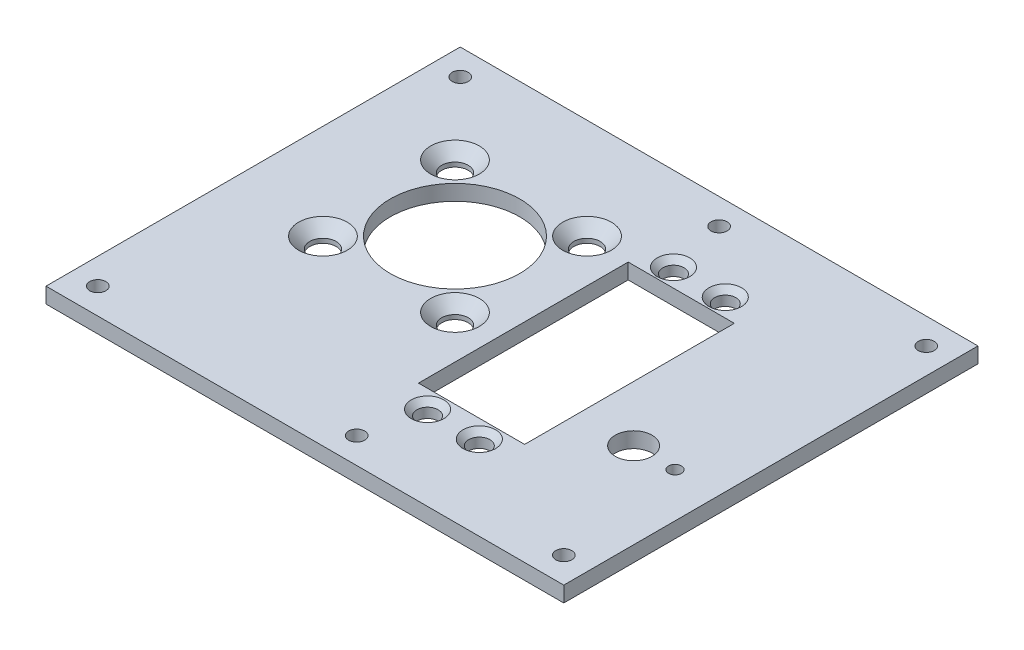
ISO-10303-21;
HEADER;
FILE_DESCRIPTION(('STEP AP214'),'2;1');
FILE_NAME('part.step','',(''),(''),'','','');
FILE_SCHEMA(('AUTOMOTIVE_DESIGN { 1 0 10303 214 1 1 1 1 }'));
ENDSEC;
DATA;
#1=APPLICATION_CONTEXT('core data for automotive mechanical design processes');
#2=APPLICATION_PROTOCOL_DEFINITION('international standard','automotive_design',2000,#1);
#3=PRODUCT_CONTEXT('',#1,'mechanical');
#4=PRODUCT('Part','Part','',(#3));
#5=PRODUCT_RELATED_PRODUCT_CATEGORY('part','',(#4));
#6=PRODUCT_DEFINITION_FORMATION('','',#4);
#7=PRODUCT_DEFINITION_CONTEXT('part definition',#1,'design');
#8=PRODUCT_DEFINITION('design','',#6,#7);
#9=PRODUCT_DEFINITION_SHAPE('','',#8);
#10=(LENGTH_UNIT() NAMED_UNIT(*) SI_UNIT(.MILLI.,.METRE.));
#11=(NAMED_UNIT(*) PLANE_ANGLE_UNIT() SI_UNIT($,.RADIAN.));
#12=(NAMED_UNIT(*) SI_UNIT($,.STERADIAN.) SOLID_ANGLE_UNIT());
#13=UNCERTAINTY_MEASURE_WITH_UNIT(LENGTH_MEASURE(1.E-05),#10,'distance_accuracy_value','');
#14=(GEOMETRIC_REPRESENTATION_CONTEXT(3) GLOBAL_UNCERTAINTY_ASSIGNED_CONTEXT((#13)) GLOBAL_UNIT_ASSIGNED_CONTEXT((#10,
#11,#12)) REPRESENTATION_CONTEXT('',''));
#15=CARTESIAN_POINT('',(0.,0.,0.));
#16=DIRECTION('',(0.,0.,1.));
#17=DIRECTION('',(1.,0.,0.));
#18=AXIS2_PLACEMENT_3D('',#15,#16,#17);
#19=CARTESIAN_POINT('',(0.,3.,-11.4110340583505));
#20=DIRECTION('',(0.,0.,-1.));
#21=DIRECTION('',(-1.,0.,0.));
#22=AXIS2_PLACEMENT_3D('',#19,#20,#21);
#23=PLANE('',#22);
#24=DIRECTION('',(1.,0.,0.));
#25=VECTOR('',#24,1.);
#26=CARTESIAN_POINT('',(0.,0.,-11.4110340583505));
#27=LINE('',#26,#25);
#28=CARTESIAN_POINT('',(13.5251162978277,0.,-11.4110340583505));
#29=VERTEX_POINT('',#28);
#30=CARTESIAN_POINT('',(34.0251162978277,0.,-11.4110340583505));
#31=VERTEX_POINT('',#30);
#32=EDGE_CURVE('E233',#29,#31,#27,.T.);
#33=ORIENTED_EDGE('',*,*,#32,.T.);
#34=DIRECTION('',(0.,-1.,0.));
#35=VECTOR('',#34,1.);
#36=CARTESIAN_POINT('',(34.0251162978277,3.,-11.4110340583505));
#37=LINE('',#36,#35);
#38=CARTESIAN_POINT('',(34.0251162978277,3.,-11.4110340583505));
#39=VERTEX_POINT('',#38);
#40=EDGE_CURVE('E11',#39,#31,#37,.T.);
#41=ORIENTED_EDGE('',*,*,#40,.F.);
#42=DIRECTION('',(1.,0.,0.));
#43=VECTOR('',#42,1.);
#44=CARTESIAN_POINT('',(0.,3.,-11.4110340583505));
#45=LINE('',#44,#43);
#46=CARTESIAN_POINT('',(13.5251162978277,3.,-11.4110340583505));
#47=VERTEX_POINT('',#46);
#48=EDGE_CURVE('E127',#47,#39,#45,.T.);
#49=ORIENTED_EDGE('',*,*,#48,.F.);
#50=DIRECTION('',(0.,-1.,0.));
#51=VECTOR('',#50,1.);
#52=CARTESIAN_POINT('',(13.5251162978277,3.,-11.4110340583505));
#53=LINE('',#52,#51);
#54=EDGE_CURVE('E67',#47,#29,#53,.T.);
#55=ORIENTED_EDGE('',*,*,#54,.T.);
#56=EDGE_LOOP('',(#33,#41,#49,#55));
#57=FACE_BOUND('',#56,.T.);
#58=ADVANCED_FACE('F47',(#57),#23,.F.);
#59=CARTESIAN_POINT('',(34.0251162978277,3.,0.));
#60=DIRECTION('',(1.,0.,0.));
#61=DIRECTION('',(0.,0.,-1.));
#62=AXIS2_PLACEMENT_3D('',#59,#60,#61);
#63=PLANE('',#62);
#64=DIRECTION('',(0.,0.,1.));
#65=VECTOR('',#64,1.);
#66=CARTESIAN_POINT('',(34.0251162978277,0.,0.));
#67=LINE('',#66,#65);
#68=CARTESIAN_POINT('',(34.0251162978277,0.,29.0889659416495));
#69=VERTEX_POINT('',#68);
#70=EDGE_CURVE('E134',#31,#69,#67,.T.);
#71=ORIENTED_EDGE('',*,*,#70,.T.);
#72=DIRECTION('',(0.,-1.,0.));
#73=VECTOR('',#72,1.);
#74=CARTESIAN_POINT('',(34.0251162978277,3.,29.0889659416495));
#75=LINE('',#74,#73);
#76=CARTESIAN_POINT('',(34.0251162978277,3.,29.0889659416495));
#77=VERTEX_POINT('',#76);
#78=EDGE_CURVE('E58',#77,#69,#75,.T.);
#79=ORIENTED_EDGE('',*,*,#78,.F.);
#80=DIRECTION('',(0.,0.,1.));
#81=VECTOR('',#80,1.);
#82=CARTESIAN_POINT('',(34.0251162978277,3.,0.));
#83=LINE('',#82,#81);
#84=EDGE_CURVE('E121',#39,#77,#83,.T.);
#85=ORIENTED_EDGE('',*,*,#84,.F.);
#86=ORIENTED_EDGE('',*,*,#40,.T.);
#87=EDGE_LOOP('',(#71,#79,#85,#86));
#88=FACE_BOUND('',#87,.T.);
#89=ADVANCED_FACE('F133',(#88),#63,.F.);
#90=CARTESIAN_POINT('',(0.,3.,29.0889659416495));
#91=DIRECTION('',(0.,0.,-1.));
#92=DIRECTION('',(-1.,0.,0.));
#93=AXIS2_PLACEMENT_3D('',#90,#91,#92);
#94=PLANE('',#93);
#95=DIRECTION('',(1.,0.,0.));
#96=VECTOR('',#95,1.);
#97=CARTESIAN_POINT('',(0.,0.,29.0889659416495));
#98=LINE('',#97,#96);
#99=CARTESIAN_POINT('',(13.5251162978277,0.,29.0889659416495));
#100=VERTEX_POINT('',#99);
#101=EDGE_CURVE('E238',#100,#69,#98,.T.);
#102=ORIENTED_EDGE('',*,*,#101,.F.);
#103=DIRECTION('',(0.,-1.,0.));
#104=VECTOR('',#103,1.);
#105=CARTESIAN_POINT('',(13.5251162978277,3.,29.0889659416495));
#106=LINE('',#105,#104);
#107=CARTESIAN_POINT('',(13.5251162978277,3.,29.0889659416495));
#108=VERTEX_POINT('',#107);
#109=EDGE_CURVE('E93',#108,#100,#106,.T.);
#110=ORIENTED_EDGE('',*,*,#109,.F.);
#111=DIRECTION('',(1.,0.,0.));
#112=VECTOR('',#111,1.);
#113=CARTESIAN_POINT('',(0.,3.,29.0889659416495));
#114=LINE('',#113,#112);
#115=EDGE_CURVE('E126',#108,#77,#114,.T.);
#116=ORIENTED_EDGE('',*,*,#115,.T.);
#117=ORIENTED_EDGE('',*,*,#78,.T.);
#118=EDGE_LOOP('',(#102,#110,#116,#117));
#119=FACE_BOUND('',#118,.T.);
#120=ADVANCED_FACE('F139',(#119),#94,.T.);
#121=CARTESIAN_POINT('',(61.3367190973659,3.,0.));
#122=DIRECTION('',(1.,0.,0.));
#123=DIRECTION('',(0.,0.,-1.));
#124=AXIS2_PLACEMENT_3D('',#121,#122,#123);
#125=PLANE('',#124);
#126=DIRECTION('',(0.,0.,1.));
#127=VECTOR('',#126,1.);
#128=CARTESIAN_POINT('',(61.3367190973659,0.,0.));
#129=LINE('',#128,#127);
#130=CARTESIAN_POINT('',(61.3367190973659,0.,-31.1610340583505));
#131=VERTEX_POINT('',#130);
#132=CARTESIAN_POINT('',(61.3367190973659,0.,48.8389659416495));
#133=VERTEX_POINT('',#132);
#134=EDGE_CURVE('E217',#131,#133,#129,.T.);
#135=ORIENTED_EDGE('',*,*,#134,.F.);
#136=DIRECTION('',(0.,-1.,0.));
#137=VECTOR('',#136,1.);
#138=CARTESIAN_POINT('',(61.3367190973659,3.,-31.1610340583505));
#139=LINE('',#138,#137);
#140=CARTESIAN_POINT('',(61.3367190973659,3.,-31.1610340583505));
#141=VERTEX_POINT('',#140);
#142=EDGE_CURVE('E51',#141,#131,#139,.T.);
#143=ORIENTED_EDGE('',*,*,#142,.F.);
#144=DIRECTION('',(0.,0.,1.));
#145=VECTOR('',#144,1.);
#146=CARTESIAN_POINT('',(61.3367190973659,3.,0.));
#147=LINE('',#146,#145);
#148=CARTESIAN_POINT('',(61.3367190973659,3.,48.8389659416495));
#149=VERTEX_POINT('',#148);
#150=EDGE_CURVE('E285',#141,#149,#147,.T.);
#151=ORIENTED_EDGE('',*,*,#150,.T.);
#152=DIRECTION('',(0.,-1.,0.));
#153=VECTOR('',#152,1.);
#154=CARTESIAN_POINT('',(61.3367190973659,3.,48.8389659416495));
#155=LINE('',#154,#153);
#156=EDGE_CURVE('E144',#149,#133,#155,.T.);
#157=ORIENTED_EDGE('',*,*,#156,.T.);
#158=EDGE_LOOP('',(#135,#143,#151,#157));
#159=FACE_BOUND('',#158,.T.);
#160=ADVANCED_FACE('F267',(#159),#125,.T.);
#161=CARTESIAN_POINT('',(0.,3.,-31.1610340583505));
#162=DIRECTION('',(0.,0.,-1.));
#163=DIRECTION('',(-1.,0.,0.));
#164=AXIS2_PLACEMENT_3D('',#161,#162,#163);
#165=PLANE('',#164);
#166=DIRECTION('',(1.,0.,0.));
#167=VECTOR('',#166,1.);
#168=CARTESIAN_POINT('',(0.,0.,-31.1610340583505));
#169=LINE('',#168,#167);
#170=CARTESIAN_POINT('',(-38.6632809026341,0.,-31.1610340583505));
#171=VERTEX_POINT('',#170);
#172=EDGE_CURVE('E221',#171,#131,#169,.T.);
#173=ORIENTED_EDGE('',*,*,#172,.F.);
#174=DIRECTION('',(0.,-1.,0.));
#175=VECTOR('',#174,1.);
#176=CARTESIAN_POINT('',(-38.6632809026341,3.,-31.1610340583505));
#177=LINE('',#176,#175);
#178=CARTESIAN_POINT('',(-38.6632809026341,3.,-31.1610340583505));
#179=VERTEX_POINT('',#178);
#180=EDGE_CURVE('E255',#179,#171,#177,.T.);
#181=ORIENTED_EDGE('',*,*,#180,.F.);
#182=DIRECTION('',(1.,0.,0.));
#183=VECTOR('',#182,1.);
#184=CARTESIAN_POINT('',(0.,3.,-31.1610340583505));
#185=LINE('',#184,#183);
#186=EDGE_CURVE('E266',#179,#141,#185,.T.);
#187=ORIENTED_EDGE('',*,*,#186,.T.);
#188=ORIENTED_EDGE('',*,*,#142,.T.);
#189=EDGE_LOOP('',(#173,#181,#187,#188));
#190=FACE_BOUND('',#189,.T.);
#191=ADVANCED_FACE('F264',(#190),#165,.T.);
#192=CARTESIAN_POINT('',(-38.6632809026341,3.,0.));
#193=DIRECTION('',(1.,0.,0.));
#194=DIRECTION('',(0.,0.,-1.));
#195=AXIS2_PLACEMENT_3D('',#192,#193,#194);
#196=PLANE('',#195);
#197=DIRECTION('',(0.,0.,1.));
#198=VECTOR('',#197,1.);
#199=CARTESIAN_POINT('',(-38.6632809026341,0.,0.));
#200=LINE('',#199,#198);
#201=CARTESIAN_POINT('',(-38.6632809026341,0.,48.8389659416495));
#202=VERTEX_POINT('',#201);
#203=EDGE_CURVE('E225',#171,#202,#200,.T.);
#204=ORIENTED_EDGE('',*,*,#203,.T.);
#205=DIRECTION('',(0.,-1.,0.));
#206=VECTOR('',#205,1.);
#207=CARTESIAN_POINT('',(-38.6632809026341,3.,48.8389659416495));
#208=LINE('',#207,#206);
#209=CARTESIAN_POINT('',(-38.6632809026341,3.,48.8389659416495));
#210=VERTEX_POINT('',#209);
#211=EDGE_CURVE('E252',#210,#202,#208,.T.);
#212=ORIENTED_EDGE('',*,*,#211,.F.);
#213=DIRECTION('',(0.,0.,1.));
#214=VECTOR('',#213,1.);
#215=CARTESIAN_POINT('',(-38.6632809026341,3.,0.));
#216=LINE('',#215,#214);
#217=EDGE_CURVE('E275',#179,#210,#216,.T.);
#218=ORIENTED_EDGE('',*,*,#217,.F.);
#219=ORIENTED_EDGE('',*,*,#180,.T.);
#220=EDGE_LOOP('',(#204,#212,#218,#219));
#221=FACE_BOUND('',#220,.T.);
#222=ADVANCED_FACE('F273',(#221),#196,.F.);
#223=CARTESIAN_POINT('',(0.,3.,48.8389659416495));
#224=DIRECTION('',(0.,0.,-1.));
#225=DIRECTION('',(-1.,0.,0.));
#226=AXIS2_PLACEMENT_3D('',#223,#224,#225);
#227=PLANE('',#226);
#228=DIRECTION('',(1.,0.,0.));
#229=VECTOR('',#228,1.);
#230=CARTESIAN_POINT('',(0.,0.,48.8389659416495));
#231=LINE('',#230,#229);
#232=EDGE_CURVE('E229',#202,#133,#231,.T.);
#233=ORIENTED_EDGE('',*,*,#232,.T.);
#234=ORIENTED_EDGE('',*,*,#156,.F.);
#235=DIRECTION('',(1.,0.,0.));
#236=VECTOR('',#235,1.);
#237=CARTESIAN_POINT('',(0.,3.,48.8389659416495));
#238=LINE('',#237,#236);
#239=EDGE_CURVE('E278',#210,#149,#238,.T.);
#240=ORIENTED_EDGE('',*,*,#239,.F.);
#241=ORIENTED_EDGE('',*,*,#211,.T.);
#242=EDGE_LOOP('',(#233,#234,#240,#241));
#243=FACE_BOUND('',#242,.T.);
#244=ADVANCED_FACE('F277',(#243),#227,.F.);
#245=CARTESIAN_POINT('',(-7.51877009888325,3.,0.993104788287176));
#246=DIRECTION('',(0.,-1.,0.));
#247=DIRECTION('',(0.,0.,-1.));
#248=AXIS2_PLACEMENT_3D('',#245,#246,#247);
#249=CYLINDRICAL_SURFACE('',#248,12.5);
#250=CARTESIAN_POINT('',(-7.51877009888325,3.,0.993104788287176));
#251=DIRECTION('',(0.,1.,0.));
#252=DIRECTION('',(0.,0.,1.));
#253=AXIS2_PLACEMENT_3D('',#250,#251,#252);
#254=CIRCLE('',#253,12.5);
#255=CARTESIAN_POINT('',(-7.51877009888325,3.,13.4931047882872));
#256=VERTEX_POINT('',#255);
#257=EDGE_CURVE('E291',#256,#256,#254,.T.);
#258=ORIENTED_EDGE('',*,*,#257,.T.);
#259=EDGE_LOOP('',(#258));
#260=FACE_BOUND('',#259,.T.);
#261=CARTESIAN_POINT('',(-7.51877009888325,0.,0.993104788287176));
#262=DIRECTION('',(0.,1.,0.));
#263=DIRECTION('',(0.,0.,1.));
#264=AXIS2_PLACEMENT_3D('',#261,#262,#263);
#265=CIRCLE('',#264,12.5);
#266=CARTESIAN_POINT('',(-7.51877009888325,0.,13.4931047882872));
#267=VERTEX_POINT('',#266);
#268=EDGE_CURVE('E213',#267,#267,#265,.T.);
#269=ORIENTED_EDGE('',*,*,#268,.F.);
#270=EDGE_LOOP('',(#269));
#271=FACE_BOUND('',#270,.T.);
#272=ADVANCED_FACE('F428',(#260,#271),#249,.F.);
#273=CARTESIAN_POINT('',(-20.2687700988833,3.,-11.7568952117128));
#274=DIRECTION('',(0.,-1.,0.));
#275=DIRECTION('',(0.,0.,-1.));
#276=AXIS2_PLACEMENT_3D('',#273,#274,#275);
#277=CYLINDRICAL_SURFACE('',#276,2.55);
#278=CARTESIAN_POINT('',(-20.2687700988833,0.85,-11.7568952117128));
#279=DIRECTION('',(0.,1.,0.));
#280=DIRECTION('',(0.,0.,1.));
#281=AXIS2_PLACEMENT_3D('',#278,#279,#280);
#282=CIRCLE('',#281,2.55);
#283=CARTESIAN_POINT('',(-20.2687700988833,0.85,-9.20689521171283));
#284=VERTEX_POINT('',#283);
#285=EDGE_CURVE('E153',#284,#284,#282,.F.);
#286=ORIENTED_EDGE('',*,*,#285,.F.);
#287=EDGE_LOOP('',(#286));
#288=FACE_BOUND('',#287,.T.);
#289=CARTESIAN_POINT('',(-20.2687700988833,0.,-11.7568952117128));
#290=DIRECTION('',(0.,1.,0.));
#291=DIRECTION('',(0.,0.,1.));
#292=AXIS2_PLACEMENT_3D('',#289,#290,#291);
#293=CIRCLE('',#292,2.55);
#294=CARTESIAN_POINT('',(-20.2687700988833,0.,-9.20689521171283));
#295=VERTEX_POINT('',#294);
#296=EDGE_CURVE('E209',#295,#295,#293,.T.);
#297=ORIENTED_EDGE('',*,*,#296,.F.);
#298=EDGE_LOOP('',(#297));
#299=FACE_BOUND('',#298,.T.);
#300=ADVANCED_FACE('F431',(#288,#299),#277,.F.);
#301=CARTESIAN_POINT('',(5.23122990111676,3.,-11.7568952117128));
#302=DIRECTION('',(0.,-1.,0.));
#303=DIRECTION('',(0.,0.,-1.));
#304=AXIS2_PLACEMENT_3D('',#301,#302,#303);
#305=CYLINDRICAL_SURFACE('',#304,2.55);
#306=CARTESIAN_POINT('',(5.23122990111676,0.850000000000001,-11.7568952117128));
#307=DIRECTION('',(0.,1.,0.));
#308=DIRECTION('',(0.,0.,1.));
#309=AXIS2_PLACEMENT_3D('',#306,#307,#308);
#310=CIRCLE('',#309,2.55);
#311=CARTESIAN_POINT('',(5.23122990111676,0.850000000000001,-9.20689521171283));
#312=VERTEX_POINT('',#311);
#313=EDGE_CURVE('E333',#312,#312,#310,.F.);
#314=ORIENTED_EDGE('',*,*,#313,.F.);
#315=EDGE_LOOP('',(#314));
#316=FACE_BOUND('',#315,.T.);
#317=CARTESIAN_POINT('',(5.23122990111676,0.,-11.7568952117128));
#318=DIRECTION('',(0.,1.,0.));
#319=DIRECTION('',(0.,0.,1.));
#320=AXIS2_PLACEMENT_3D('',#317,#318,#319);
#321=CIRCLE('',#320,2.55);
#322=CARTESIAN_POINT('',(5.23122990111676,0.,-9.20689521171283));
#323=VERTEX_POINT('',#322);
#324=EDGE_CURVE('E205',#323,#323,#321,.T.);
#325=ORIENTED_EDGE('',*,*,#324,.F.);
#326=EDGE_LOOP('',(#325));
#327=FACE_BOUND('',#326,.T.);
#328=ADVANCED_FACE('F466',(#316,#327),#305,.F.);
#329=CARTESIAN_POINT('',(5.23122990111676,3.,13.7431047882872));
#330=DIRECTION('',(0.,-1.,0.));
#331=DIRECTION('',(0.,0.,-1.));
#332=AXIS2_PLACEMENT_3D('',#329,#330,#331);
#333=CYLINDRICAL_SURFACE('',#332,2.55);
#334=CARTESIAN_POINT('',(5.23122990111676,0.850000000000001,13.7431047882872));
#335=DIRECTION('',(0.,1.,0.));
#336=DIRECTION('',(0.,0.,1.));
#337=AXIS2_PLACEMENT_3D('',#334,#335,#336);
#338=CIRCLE('',#337,2.55);
#339=CARTESIAN_POINT('',(5.23122990111676,0.850000000000001,16.2931047882872));
#340=VERTEX_POINT('',#339);
#341=EDGE_CURVE('E341',#340,#340,#338,.F.);
#342=ORIENTED_EDGE('',*,*,#341,.F.);
#343=EDGE_LOOP('',(#342));
#344=FACE_BOUND('',#343,.T.);
#345=CARTESIAN_POINT('',(5.23122990111676,0.,13.7431047882872));
#346=DIRECTION('',(0.,1.,0.));
#347=DIRECTION('',(0.,0.,1.));
#348=AXIS2_PLACEMENT_3D('',#345,#346,#347);
#349=CIRCLE('',#348,2.55);
#350=CARTESIAN_POINT('',(5.23122990111676,0.,16.2931047882872));
#351=VERTEX_POINT('',#350);
#352=EDGE_CURVE('E201',#351,#351,#349,.T.);
#353=ORIENTED_EDGE('',*,*,#352,.F.);
#354=EDGE_LOOP('',(#353));
#355=FACE_BOUND('',#354,.T.);
#356=ADVANCED_FACE('F470',(#344,#355),#333,.F.);
#357=CARTESIAN_POINT('',(-20.2687700988832,3.,13.7431047882872));
#358=DIRECTION('',(0.,-1.,0.));
#359=DIRECTION('',(0.,0.,-1.));
#360=AXIS2_PLACEMENT_3D('',#357,#358,#359);
#361=CYLINDRICAL_SURFACE('',#360,2.55);
#362=CARTESIAN_POINT('',(-20.2687700988832,0.85,13.7431047882872));
#363=DIRECTION('',(0.,1.,0.));
#364=DIRECTION('',(0.,0.,1.));
#365=AXIS2_PLACEMENT_3D('',#362,#363,#364);
#366=CIRCLE('',#365,2.55);
#367=CARTESIAN_POINT('',(-20.2687700988832,0.85,16.2931047882872));
#368=VERTEX_POINT('',#367);
#369=EDGE_CURVE('E349',#368,#368,#366,.F.);
#370=ORIENTED_EDGE('',*,*,#369,.F.);
#371=EDGE_LOOP('',(#370));
#372=FACE_BOUND('',#371,.T.);
#373=CARTESIAN_POINT('',(-20.2687700988832,0.,13.7431047882872));
#374=DIRECTION('',(0.,1.,0.));
#375=DIRECTION('',(0.,0.,1.));
#376=AXIS2_PLACEMENT_3D('',#373,#374,#375);
#377=CIRCLE('',#376,2.55);
#378=CARTESIAN_POINT('',(-20.2687700988832,0.,16.2931047882872));
#379=VERTEX_POINT('',#378);
#380=EDGE_CURVE('E197',#379,#379,#377,.T.);
#381=ORIENTED_EDGE('',*,*,#380,.F.);
#382=EDGE_LOOP('',(#381));
#383=FACE_BOUND('',#382,.T.);
#384=ADVANCED_FACE('F474',(#372,#383),#361,.F.);
#385=CARTESIAN_POINT('',(18.7751162978277,3.,-14.9110340583505));
#386=DIRECTION('',(0.,-1.,0.));
#387=DIRECTION('',(0.,0.,-1.));
#388=AXIS2_PLACEMENT_3D('',#385,#386,#387);
#389=CYLINDRICAL_SURFACE('',#388,2.05);
#390=CARTESIAN_POINT('',(18.7751162978277,1.9,-14.9110340583505));
#391=DIRECTION('',(0.,1.,0.));
#392=DIRECTION('',(0.,0.,1.));
#393=AXIS2_PLACEMENT_3D('',#390,#391,#392);
#394=CIRCLE('',#393,2.05);
#395=CARTESIAN_POINT('',(18.7751162978277,1.9,-12.8610340583505));
#396=VERTEX_POINT('',#395);
#397=EDGE_CURVE('E381',#396,#396,#394,.F.);
#398=ORIENTED_EDGE('',*,*,#397,.F.);
#399=EDGE_LOOP('',(#398));
#400=FACE_BOUND('',#399,.T.);
#401=CARTESIAN_POINT('',(18.7751162978277,0.,-14.9110340583505));
#402=DIRECTION('',(0.,1.,0.));
#403=DIRECTION('',(0.,0.,1.));
#404=AXIS2_PLACEMENT_3D('',#401,#402,#403);
#405=CIRCLE('',#404,2.05);
#406=CARTESIAN_POINT('',(18.7751162978277,0.,-12.8610340583505));
#407=VERTEX_POINT('',#406);
#408=EDGE_CURVE('E193',#407,#407,#405,.T.);
#409=ORIENTED_EDGE('',*,*,#408,.F.);
#410=EDGE_LOOP('',(#409));
#411=FACE_BOUND('',#410,.T.);
#412=ADVANCED_FACE('F478',(#400,#411),#389,.F.);
#413=CARTESIAN_POINT('',(28.7751162978277,3.,-14.9110340583505));
#414=DIRECTION('',(0.,-1.,0.));
#415=DIRECTION('',(0.,0.,-1.));
#416=AXIS2_PLACEMENT_3D('',#413,#414,#415);
#417=CYLINDRICAL_SURFACE('',#416,2.05);
#418=CARTESIAN_POINT('',(28.7751162978277,1.9,-14.9110340583505));
#419=DIRECTION('',(0.,1.,0.));
#420=DIRECTION('',(0.,0.,1.));
#421=AXIS2_PLACEMENT_3D('',#418,#419,#420);
#422=CIRCLE('',#421,2.05);
#423=CARTESIAN_POINT('',(28.7751162978277,1.9,-12.8610340583505));
#424=VERTEX_POINT('',#423);
#425=EDGE_CURVE('E373',#424,#424,#422,.F.);
#426=ORIENTED_EDGE('',*,*,#425,.F.);
#427=EDGE_LOOP('',(#426));
#428=FACE_BOUND('',#427,.T.);
#429=CARTESIAN_POINT('',(28.7751162978277,0.,-14.9110340583505));
#430=DIRECTION('',(0.,1.,0.));
#431=DIRECTION('',(0.,0.,1.));
#432=AXIS2_PLACEMENT_3D('',#429,#430,#431);
#433=CIRCLE('',#432,2.05);
#434=CARTESIAN_POINT('',(28.7751162978277,0.,-12.8610340583505));
#435=VERTEX_POINT('',#434);
#436=EDGE_CURVE('E189',#435,#435,#433,.T.);
#437=ORIENTED_EDGE('',*,*,#436,.F.);
#438=EDGE_LOOP('',(#437));
#439=FACE_BOUND('',#438,.T.);
#440=ADVANCED_FACE('F482',(#428,#439),#417,.F.);
#441=CARTESIAN_POINT('',(18.7751162978277,3.,32.5889659416495));
#442=DIRECTION('',(0.,-1.,0.));
#443=DIRECTION('',(0.,0.,-1.));
#444=AXIS2_PLACEMENT_3D('',#441,#442,#443);
#445=CYLINDRICAL_SURFACE('',#444,2.05);
#446=CARTESIAN_POINT('',(18.7751162978277,1.9,32.5889659416495));
#447=DIRECTION('',(0.,1.,0.));
#448=DIRECTION('',(0.,0.,1.));
#449=AXIS2_PLACEMENT_3D('',#446,#447,#448);
#450=CIRCLE('',#449,2.05);
#451=CARTESIAN_POINT('',(18.7751162978277,1.9,34.6389659416496));
#452=VERTEX_POINT('',#451);
#453=EDGE_CURVE('E365',#452,#452,#450,.F.);
#454=ORIENTED_EDGE('',*,*,#453,.F.);
#455=EDGE_LOOP('',(#454));
#456=FACE_BOUND('',#455,.T.);
#457=CARTESIAN_POINT('',(18.7751162978277,0.,32.5889659416495));
#458=DIRECTION('',(0.,1.,0.));
#459=DIRECTION('',(0.,0.,1.));
#460=AXIS2_PLACEMENT_3D('',#457,#458,#459);
#461=CIRCLE('',#460,2.05);
#462=CARTESIAN_POINT('',(18.7751162978277,0.,34.6389659416496));
#463=VERTEX_POINT('',#462);
#464=EDGE_CURVE('E185',#463,#463,#461,.T.);
#465=ORIENTED_EDGE('',*,*,#464,.F.);
#466=EDGE_LOOP('',(#465));
#467=FACE_BOUND('',#466,.T.);
#468=ADVANCED_FACE('F486',(#456,#467),#445,.F.);
#469=CARTESIAN_POINT('',(28.7751162978277,3.,32.5889659416495));
#470=DIRECTION('',(0.,-1.,0.));
#471=DIRECTION('',(0.,0.,-1.));
#472=AXIS2_PLACEMENT_3D('',#469,#470,#471);
#473=CYLINDRICAL_SURFACE('',#472,2.05);
#474=CARTESIAN_POINT('',(28.7751162978277,1.9,32.5889659416495));
#475=DIRECTION('',(0.,1.,0.));
#476=DIRECTION('',(0.,0.,1.));
#477=AXIS2_PLACEMENT_3D('',#474,#475,#476);
#478=CIRCLE('',#477,2.05);
#479=CARTESIAN_POINT('',(28.7751162978277,1.9,34.6389659416496));
#480=VERTEX_POINT('',#479);
#481=EDGE_CURVE('E357',#480,#480,#478,.F.);
#482=ORIENTED_EDGE('',*,*,#481,.F.);
#483=EDGE_LOOP('',(#482));
#484=FACE_BOUND('',#483,.T.);
#485=CARTESIAN_POINT('',(28.7751162978277,0.,32.5889659416495));
#486=DIRECTION('',(0.,1.,0.));
#487=DIRECTION('',(0.,0.,1.));
#488=AXIS2_PLACEMENT_3D('',#485,#486,#487);
#489=CIRCLE('',#488,2.05);
#490=CARTESIAN_POINT('',(28.7751162978277,0.,34.6389659416496));
#491=VERTEX_POINT('',#490);
#492=EDGE_CURVE('E181',#491,#491,#489,.T.);
#493=ORIENTED_EDGE('',*,*,#492,.F.);
#494=EDGE_LOOP('',(#493));
#495=FACE_BOUND('',#494,.T.);
#496=ADVANCED_FACE('F490',(#484,#495),#473,.F.);
#497=CARTESIAN_POINT('',(44.7751162978277,3.,18.7889659416495));
#498=DIRECTION('',(0.,-1.,0.));
#499=DIRECTION('',(0.,0.,-1.));
#500=AXIS2_PLACEMENT_3D('',#497,#498,#499);
#501=CYLINDRICAL_SURFACE('',#500,3.55);
#502=CARTESIAN_POINT('',(44.7751162978277,3.,18.7889659416495));
#503=DIRECTION('',(0.,1.,0.));
#504=DIRECTION('',(0.,0.,1.));
#505=AXIS2_PLACEMENT_3D('',#502,#503,#504);
#506=CIRCLE('',#505,3.55);
#507=CARTESIAN_POINT('',(44.7751162978277,3.,22.3389659416495));
#508=VERTEX_POINT('',#507);
#509=EDGE_CURVE('E295',#508,#508,#506,.T.);
#510=ORIENTED_EDGE('',*,*,#509,.T.);
#511=EDGE_LOOP('',(#510));
#512=FACE_BOUND('',#511,.T.);
#513=CARTESIAN_POINT('',(44.7751162978277,0.,18.7889659416495));
#514=DIRECTION('',(0.,1.,0.));
#515=DIRECTION('',(0.,0.,1.));
#516=AXIS2_PLACEMENT_3D('',#513,#514,#515);
#517=CIRCLE('',#516,3.55);
#518=CARTESIAN_POINT('',(44.7751162978277,0.,22.3389659416495));
#519=VERTEX_POINT('',#518);
#520=EDGE_CURVE('E177',#519,#519,#517,.T.);
#521=ORIENTED_EDGE('',*,*,#520,.F.);
#522=EDGE_LOOP('',(#521));
#523=FACE_BOUND('',#522,.T.);
#524=ADVANCED_FACE('F494',(#512,#523),#501,.F.);
#525=CARTESIAN_POINT('',(-33.6632809026341,3.,-26.1610340583505));
#526=DIRECTION('',(0.,-1.,0.));
#527=DIRECTION('',(0.,0.,-1.));
#528=AXIS2_PLACEMENT_3D('',#525,#526,#527);
#529=CYLINDRICAL_SURFACE('',#528,1.55);
#530=CARTESIAN_POINT('',(-33.6632809026341,3.,-26.1610340583505));
#531=DIRECTION('',(0.,1.,0.));
#532=DIRECTION('',(0.,0.,1.));
#533=AXIS2_PLACEMENT_3D('',#530,#531,#532);
#534=CIRCLE('',#533,1.55);
#535=CARTESIAN_POINT('',(-33.6632809026341,3.,-24.6110340583505));
#536=VERTEX_POINT('',#535);
#537=EDGE_CURVE('E299',#536,#536,#534,.T.);
#538=ORIENTED_EDGE('',*,*,#537,.T.);
#539=EDGE_LOOP('',(#538));
#540=FACE_BOUND('',#539,.T.);
#541=CARTESIAN_POINT('',(-33.6632809026341,0.,-26.1610340583505));
#542=DIRECTION('',(0.,1.,0.));
#543=DIRECTION('',(0.,0.,1.));
#544=AXIS2_PLACEMENT_3D('',#541,#542,#543);
#545=CIRCLE('',#544,1.55);
#546=CARTESIAN_POINT('',(-33.6632809026341,0.,-24.6110340583505));
#547=VERTEX_POINT('',#546);
#548=EDGE_CURVE('E173',#547,#547,#545,.T.);
#549=ORIENTED_EDGE('',*,*,#548,.F.);
#550=EDGE_LOOP('',(#549));
#551=FACE_BOUND('',#550,.T.);
#552=ADVANCED_FACE('F498',(#540,#551),#529,.F.);
#553=CARTESIAN_POINT('',(56.3367190973659,3.,-26.1610340583505));
#554=DIRECTION('',(0.,-1.,0.));
#555=DIRECTION('',(0.,0.,-1.));
#556=AXIS2_PLACEMENT_3D('',#553,#554,#555);
#557=CYLINDRICAL_SURFACE('',#556,1.55);
#558=CARTESIAN_POINT('',(56.3367190973659,3.,-26.1610340583505));
#559=DIRECTION('',(0.,1.,0.));
#560=DIRECTION('',(0.,0.,1.));
#561=AXIS2_PLACEMENT_3D('',#558,#559,#560);
#562=CIRCLE('',#561,1.55);
#563=CARTESIAN_POINT('',(56.3367190973659,3.,-24.6110340583505));
#564=VERTEX_POINT('',#563);
#565=EDGE_CURVE('E303',#564,#564,#562,.T.);
#566=ORIENTED_EDGE('',*,*,#565,.T.);
#567=EDGE_LOOP('',(#566));
#568=FACE_BOUND('',#567,.T.);
#569=CARTESIAN_POINT('',(56.3367190973659,0.,-26.1610340583505));
#570=DIRECTION('',(0.,1.,0.));
#571=DIRECTION('',(0.,0.,1.));
#572=AXIS2_PLACEMENT_3D('',#569,#570,#571);
#573=CIRCLE('',#572,1.55);
#574=CARTESIAN_POINT('',(56.3367190973659,0.,-24.6110340583505));
#575=VERTEX_POINT('',#574);
#576=EDGE_CURVE('E169',#575,#575,#573,.T.);
#577=ORIENTED_EDGE('',*,*,#576,.F.);
#578=EDGE_LOOP('',(#577));
#579=FACE_BOUND('',#578,.T.);
#580=ADVANCED_FACE('F502',(#568,#579),#557,.F.);
#581=CARTESIAN_POINT('',(56.3367190973659,3.,43.8389659416495));
#582=DIRECTION('',(0.,-1.,0.));
#583=DIRECTION('',(0.,0.,-1.));
#584=AXIS2_PLACEMENT_3D('',#581,#582,#583);
#585=CYLINDRICAL_SURFACE('',#584,1.55);
#586=CARTESIAN_POINT('',(56.3367190973659,3.,43.8389659416495));
#587=DIRECTION('',(0.,1.,0.));
#588=DIRECTION('',(0.,0.,1.));
#589=AXIS2_PLACEMENT_3D('',#586,#587,#588);
#590=CIRCLE('',#589,1.55);
#591=CARTESIAN_POINT('',(56.3367190973659,3.,45.3889659416496));
#592=VERTEX_POINT('',#591);
#593=EDGE_CURVE('E307',#592,#592,#590,.T.);
#594=ORIENTED_EDGE('',*,*,#593,.T.);
#595=EDGE_LOOP('',(#594));
#596=FACE_BOUND('',#595,.T.);
#597=CARTESIAN_POINT('',(56.3367190973659,0.,43.8389659416495));
#598=DIRECTION('',(0.,1.,0.));
#599=DIRECTION('',(0.,0.,1.));
#600=AXIS2_PLACEMENT_3D('',#597,#598,#599);
#601=CIRCLE('',#600,1.55);
#602=CARTESIAN_POINT('',(56.3367190973659,0.,45.3889659416496));
#603=VERTEX_POINT('',#602);
#604=EDGE_CURVE('E165',#603,#603,#601,.T.);
#605=ORIENTED_EDGE('',*,*,#604,.F.);
#606=EDGE_LOOP('',(#605));
#607=FACE_BOUND('',#606,.T.);
#608=ADVANCED_FACE('F506',(#596,#607),#585,.F.);
#609=CARTESIAN_POINT('',(-33.6632809026341,3.,43.8389659416495));
#610=DIRECTION('',(0.,-1.,0.));
#611=DIRECTION('',(0.,0.,-1.));
#612=AXIS2_PLACEMENT_3D('',#609,#610,#611);
#613=CYLINDRICAL_SURFACE('',#612,1.55);
#614=CARTESIAN_POINT('',(-33.6632809026341,3.,43.8389659416495));
#615=DIRECTION('',(0.,1.,0.));
#616=DIRECTION('',(0.,0.,1.));
#617=AXIS2_PLACEMENT_3D('',#614,#615,#616);
#618=CIRCLE('',#617,1.55);
#619=CARTESIAN_POINT('',(-33.6632809026341,3.,45.3889659416496));
#620=VERTEX_POINT('',#619);
#621=EDGE_CURVE('E311',#620,#620,#618,.T.);
#622=ORIENTED_EDGE('',*,*,#621,.T.);
#623=EDGE_LOOP('',(#622));
#624=FACE_BOUND('',#623,.T.);
#625=CARTESIAN_POINT('',(-33.6632809026341,0.,43.8389659416495));
#626=DIRECTION('',(0.,1.,0.));
#627=DIRECTION('',(0.,0.,1.));
#628=AXIS2_PLACEMENT_3D('',#625,#626,#627);
#629=CIRCLE('',#628,1.55);
#630=CARTESIAN_POINT('',(-33.6632809026341,0.,45.3889659416496));
#631=VERTEX_POINT('',#630);
#632=EDGE_CURVE('E161',#631,#631,#629,.T.);
#633=ORIENTED_EDGE('',*,*,#632,.F.);
#634=EDGE_LOOP('',(#633));
#635=FACE_BOUND('',#634,.T.);
#636=ADVANCED_FACE('F510',(#624,#635),#613,.F.);
#637=CARTESIAN_POINT('',(16.3367190973659,3.,-26.1610340583505));
#638=DIRECTION('',(0.,-1.,0.));
#639=DIRECTION('',(0.,0.,-1.));
#640=AXIS2_PLACEMENT_3D('',#637,#638,#639);
#641=CYLINDRICAL_SURFACE('',#640,1.55);
#642=CARTESIAN_POINT('',(16.3367190973659,3.,-26.1610340583505));
#643=DIRECTION('',(0.,1.,0.));
#644=DIRECTION('',(0.,0.,1.));
#645=AXIS2_PLACEMENT_3D('',#642,#643,#644);
#646=CIRCLE('',#645,1.55);
#647=CARTESIAN_POINT('',(16.3367190973659,3.,-24.6110340583505));
#648=VERTEX_POINT('',#647);
#649=EDGE_CURVE('E315',#648,#648,#646,.T.);
#650=ORIENTED_EDGE('',*,*,#649,.T.);
#651=EDGE_LOOP('',(#650));
#652=FACE_BOUND('',#651,.T.);
#653=CARTESIAN_POINT('',(16.3367190973659,0.,-26.1610340583505));
#654=DIRECTION('',(0.,1.,0.));
#655=DIRECTION('',(0.,0.,1.));
#656=AXIS2_PLACEMENT_3D('',#653,#654,#655);
#657=CIRCLE('',#656,1.55);
#658=CARTESIAN_POINT('',(16.3367190973659,0.,-24.6110340583505));
#659=VERTEX_POINT('',#658);
#660=EDGE_CURVE('E157',#659,#659,#657,.T.);
#661=ORIENTED_EDGE('',*,*,#660,.F.);
#662=EDGE_LOOP('',(#661));
#663=FACE_BOUND('',#662,.T.);
#664=ADVANCED_FACE('F514',(#652,#663),#641,.F.);
#665=CARTESIAN_POINT('',(16.3367190973659,3.,43.8389659416495));
#666=DIRECTION('',(0.,-1.,0.));
#667=DIRECTION('',(0.,0.,-1.));
#668=AXIS2_PLACEMENT_3D('',#665,#666,#667);
#669=CYLINDRICAL_SURFACE('',#668,1.55);
#670=CARTESIAN_POINT('',(16.3367190973659,3.,43.8389659416495));
#671=DIRECTION('',(0.,1.,0.));
#672=DIRECTION('',(0.,0.,1.));
#673=AXIS2_PLACEMENT_3D('',#670,#671,#672);
#674=CIRCLE('',#673,1.55);
#675=CARTESIAN_POINT('',(16.3367190973659,3.,45.3889659416496));
#676=VERTEX_POINT('',#675);
#677=EDGE_CURVE('E319',#676,#676,#674,.T.);
#678=ORIENTED_EDGE('',*,*,#677,.T.);
#679=EDGE_LOOP('',(#678));
#680=FACE_BOUND('',#679,.T.);
#681=CARTESIAN_POINT('',(16.3367190973659,0.,43.8389659416495));
#682=DIRECTION('',(0.,1.,0.));
#683=DIRECTION('',(0.,0.,1.));
#684=AXIS2_PLACEMENT_3D('',#681,#682,#683);
#685=CIRCLE('',#684,1.55);
#686=CARTESIAN_POINT('',(16.3367190973659,0.,45.3889659416496));
#687=VERTEX_POINT('',#686);
#688=EDGE_CURVE('E152',#687,#687,#685,.T.);
#689=ORIENTED_EDGE('',*,*,#688,.F.);
#690=EDGE_LOOP('',(#689));
#691=FACE_BOUND('',#690,.T.);
#692=ADVANCED_FACE('F517',(#680,#691),#669,.F.);
#693=CARTESIAN_POINT('',(52.7751162978277,3.,18.7889659416495));
#694=DIRECTION('',(0.,-1.,0.));
#695=DIRECTION('',(0.,0.,-1.));
#696=AXIS2_PLACEMENT_3D('',#693,#694,#695);
#697=CYLINDRICAL_SURFACE('',#696,1.25);
#698=CARTESIAN_POINT('',(52.7751162978277,3.,18.7889659416495));
#699=DIRECTION('',(0.,1.,0.));
#700=DIRECTION('',(0.,0.,1.));
#701=AXIS2_PLACEMENT_3D('',#698,#699,#700);
#702=CIRCLE('',#701,1.25);
#703=CARTESIAN_POINT('',(52.7751162978277,3.,20.0389659416496));
#704=VERTEX_POINT('',#703);
#705=EDGE_CURVE('E245',#704,#704,#702,.T.);
#706=ORIENTED_EDGE('',*,*,#705,.T.);
#707=EDGE_LOOP('',(#706));
#708=FACE_BOUND('',#707,.T.);
#709=CARTESIAN_POINT('',(52.7751162978277,0.,18.7889659416495));
#710=DIRECTION('',(0.,1.,0.));
#711=DIRECTION('',(0.,0.,1.));
#712=AXIS2_PLACEMENT_3D('',#709,#710,#711);
#713=CIRCLE('',#712,1.25);
#714=CARTESIAN_POINT('',(52.7751162978277,0.,20.0389659416496));
#715=VERTEX_POINT('',#714);
#716=EDGE_CURVE('E148',#715,#715,#713,.T.);
#717=ORIENTED_EDGE('',*,*,#716,.F.);
#718=EDGE_LOOP('',(#717));
#719=FACE_BOUND('',#718,.T.);
#720=ADVANCED_FACE('F49',(#708,#719),#697,.F.);
#721=CARTESIAN_POINT('',(13.5251162978277,3.,0.));
#722=DIRECTION('',(1.,0.,0.));
#723=DIRECTION('',(0.,0.,-1.));
#724=AXIS2_PLACEMENT_3D('',#721,#722,#723);
#725=PLANE('',#724);
#726=DIRECTION('',(0.,0.,1.));
#727=VECTOR('',#726,1.);
#728=CARTESIAN_POINT('',(13.5251162978277,0.,0.));
#729=LINE('',#728,#727);
#730=EDGE_CURVE('E241',#29,#100,#729,.T.);
#731=ORIENTED_EDGE('',*,*,#730,.F.);
#732=ORIENTED_EDGE('',*,*,#54,.F.);
#733=DIRECTION('',(0.,0.,1.));
#734=VECTOR('',#733,1.);
#735=CARTESIAN_POINT('',(13.5251162978277,3.,0.));
#736=LINE('',#735,#734);
#737=EDGE_CURVE('E141',#47,#108,#736,.T.);
#738=ORIENTED_EDGE('',*,*,#737,.T.);
#739=ORIENTED_EDGE('',*,*,#109,.T.);
#740=EDGE_LOOP('',(#731,#732,#738,#739));
#741=FACE_BOUND('',#740,.T.);
#742=ADVANCED_FACE('F394',(#741),#725,.T.);
#743=CARTESIAN_POINT('',(0.,3.,0.));
#744=DIRECTION('',(0.,1.,0.));
#745=DIRECTION('',(0.,0.,1.));
#746=AXIS2_PLACEMENT_3D('',#743,#744,#745);
#747=PLANE('',#746);
#748=CARTESIAN_POINT('',(18.7751162978277,3.,-14.9110340583505));
#749=DIRECTION('',(0.,1.,0.));
#750=DIRECTION('',(0.,0.,1.));
#751=AXIS2_PLACEMENT_3D('',#748,#749,#750);
#752=CIRCLE('',#751,3.15);
#753=CARTESIAN_POINT('',(18.7751162978277,3.,-11.7610340583505));
#754=VERTEX_POINT('',#753);
#755=EDGE_CURVE('E385',#754,#754,#752,.T.);
#756=ORIENTED_EDGE('',*,*,#755,.F.);
#757=EDGE_LOOP('',(#756));
#758=FACE_BOUND('',#757,.T.);
#759=CARTESIAN_POINT('',(28.7751162978277,3.,-14.9110340583505));
#760=DIRECTION('',(0.,1.,0.));
#761=DIRECTION('',(0.,0.,1.));
#762=AXIS2_PLACEMENT_3D('',#759,#760,#761);
#763=CIRCLE('',#762,3.15);
#764=CARTESIAN_POINT('',(28.7751162978277,3.,-11.7610340583505));
#765=VERTEX_POINT('',#764);
#766=EDGE_CURVE('E377',#765,#765,#763,.T.);
#767=ORIENTED_EDGE('',*,*,#766,.F.);
#768=EDGE_LOOP('',(#767));
#769=FACE_BOUND('',#768,.T.);
#770=CARTESIAN_POINT('',(18.7751162978277,3.,32.5889659416495));
#771=DIRECTION('',(0.,1.,0.));
#772=DIRECTION('',(0.,0.,1.));
#773=AXIS2_PLACEMENT_3D('',#770,#771,#772);
#774=CIRCLE('',#773,3.15);
#775=CARTESIAN_POINT('',(18.7751162978277,3.,35.7389659416495));
#776=VERTEX_POINT('',#775);
#777=EDGE_CURVE('E369',#776,#776,#774,.T.);
#778=ORIENTED_EDGE('',*,*,#777,.F.);
#779=EDGE_LOOP('',(#778));
#780=FACE_BOUND('',#779,.T.);
#781=CARTESIAN_POINT('',(28.7751162978277,3.,32.5889659416495));
#782=DIRECTION('',(0.,1.,0.));
#783=DIRECTION('',(0.,0.,1.));
#784=AXIS2_PLACEMENT_3D('',#781,#782,#783);
#785=CIRCLE('',#784,3.15);
#786=CARTESIAN_POINT('',(28.7751162978277,3.,35.7389659416495));
#787=VERTEX_POINT('',#786);
#788=EDGE_CURVE('E361',#787,#787,#785,.T.);
#789=ORIENTED_EDGE('',*,*,#788,.F.);
#790=EDGE_LOOP('',(#789));
#791=FACE_BOUND('',#790,.T.);
#792=CARTESIAN_POINT('',(-20.2687700988832,3.,13.7431047882872));
#793=DIRECTION('',(0.,1.,0.));
#794=DIRECTION('',(0.,0.,1.));
#795=AXIS2_PLACEMENT_3D('',#792,#793,#794);
#796=CIRCLE('',#795,4.7);
#797=CARTESIAN_POINT('',(-20.2687700988832,3.,18.4431047882872));
#798=VERTEX_POINT('',#797);
#799=EDGE_CURVE('E353',#798,#798,#796,.T.);
#800=ORIENTED_EDGE('',*,*,#799,.F.);
#801=EDGE_LOOP('',(#800));
#802=FACE_BOUND('',#801,.T.);
#803=CARTESIAN_POINT('',(5.23122990111676,3.,13.7431047882872));
#804=DIRECTION('',(0.,1.,0.));
#805=DIRECTION('',(0.,0.,1.));
#806=AXIS2_PLACEMENT_3D('',#803,#804,#805);
#807=CIRCLE('',#806,4.7);
#808=CARTESIAN_POINT('',(5.23122990111676,3.,18.4431047882872));
#809=VERTEX_POINT('',#808);
#810=EDGE_CURVE('E345',#809,#809,#807,.T.);
#811=ORIENTED_EDGE('',*,*,#810,.F.);
#812=EDGE_LOOP('',(#811));
#813=FACE_BOUND('',#812,.T.);
#814=CARTESIAN_POINT('',(5.23122990111676,3.,-11.7568952117128));
#815=DIRECTION('',(0.,1.,0.));
#816=DIRECTION('',(0.,0.,1.));
#817=AXIS2_PLACEMENT_3D('',#814,#815,#816);
#818=CIRCLE('',#817,4.7);
#819=CARTESIAN_POINT('',(5.23122990111676,3.,-7.05689521171283));
#820=VERTEX_POINT('',#819);
#821=EDGE_CURVE('E337',#820,#820,#818,.T.);
#822=ORIENTED_EDGE('',*,*,#821,.F.);
#823=EDGE_LOOP('',(#822));
#824=FACE_BOUND('',#823,.T.);
#825=CARTESIAN_POINT('',(-20.2687700988833,3.,-11.7568952117128));
#826=DIRECTION('',(0.,1.,0.));
#827=DIRECTION('',(0.,0.,1.));
#828=AXIS2_PLACEMENT_3D('',#825,#826,#827);
#829=CIRCLE('',#828,4.7);
#830=CARTESIAN_POINT('',(-20.2687700988833,3.,-7.05689521171283));
#831=VERTEX_POINT('',#830);
#832=EDGE_CURVE('E329',#831,#831,#829,.T.);
#833=ORIENTED_EDGE('',*,*,#832,.F.);
#834=EDGE_LOOP('',(#833));
#835=FACE_BOUND('',#834,.T.);
#836=ORIENTED_EDGE('',*,*,#705,.F.);
#837=EDGE_LOOP('',(#836));
#838=FACE_BOUND('',#837,.T.);
#839=ORIENTED_EDGE('',*,*,#677,.F.);
#840=EDGE_LOOP('',(#839));
#841=FACE_BOUND('',#840,.T.);
#842=ORIENTED_EDGE('',*,*,#649,.F.);
#843=EDGE_LOOP('',(#842));
#844=FACE_BOUND('',#843,.T.);
#845=ORIENTED_EDGE('',*,*,#621,.F.);
#846=EDGE_LOOP('',(#845));
#847=FACE_BOUND('',#846,.T.);
#848=ORIENTED_EDGE('',*,*,#593,.F.);
#849=EDGE_LOOP('',(#848));
#850=FACE_BOUND('',#849,.T.);
#851=ORIENTED_EDGE('',*,*,#565,.F.);
#852=EDGE_LOOP('',(#851));
#853=FACE_BOUND('',#852,.T.);
#854=ORIENTED_EDGE('',*,*,#537,.F.);
#855=EDGE_LOOP('',(#854));
#856=FACE_BOUND('',#855,.T.);
#857=ORIENTED_EDGE('',*,*,#509,.F.);
#858=EDGE_LOOP('',(#857));
#859=FACE_BOUND('',#858,.T.);
#860=ORIENTED_EDGE('',*,*,#257,.F.);
#861=EDGE_LOOP('',(#860));
#862=FACE_BOUND('',#861,.T.);
#863=ORIENTED_EDGE('',*,*,#150,.F.);
#864=ORIENTED_EDGE('',*,*,#186,.F.);
#865=ORIENTED_EDGE('',*,*,#217,.T.);
#866=ORIENTED_EDGE('',*,*,#239,.T.);
#867=EDGE_LOOP('',(#863,#864,#865,#866));
#868=FACE_BOUND('',#867,.T.);
#869=ORIENTED_EDGE('',*,*,#48,.T.);
#870=ORIENTED_EDGE('',*,*,#84,.T.);
#871=ORIENTED_EDGE('',*,*,#115,.F.);
#872=ORIENTED_EDGE('',*,*,#737,.F.);
#873=EDGE_LOOP('',(#869,#870,#871,#872));
#874=FACE_BOUND('',#873,.T.);
#875=ADVANCED_FACE('F123',(#758,#769,#780,#791,#802,#813,#824,#835,#838,#841,#844,#847,#850,
#853,#856,#859,#862,#868,#874),#747,.T.);
#876=CARTESIAN_POINT('',(0.,0.,0.));
#877=DIRECTION('',(0.,1.,0.));
#878=DIRECTION('',(0.,0.,1.));
#879=AXIS2_PLACEMENT_3D('',#876,#877,#878);
#880=PLANE('',#879);
#881=ORIENTED_EDGE('',*,*,#716,.T.);
#882=EDGE_LOOP('',(#881));
#883=FACE_BOUND('',#882,.T.);
#884=ORIENTED_EDGE('',*,*,#688,.T.);
#885=EDGE_LOOP('',(#884));
#886=FACE_BOUND('',#885,.T.);
#887=ORIENTED_EDGE('',*,*,#660,.T.);
#888=EDGE_LOOP('',(#887));
#889=FACE_BOUND('',#888,.T.);
#890=ORIENTED_EDGE('',*,*,#632,.T.);
#891=EDGE_LOOP('',(#890));
#892=FACE_BOUND('',#891,.T.);
#893=ORIENTED_EDGE('',*,*,#604,.T.);
#894=EDGE_LOOP('',(#893));
#895=FACE_BOUND('',#894,.T.);
#896=ORIENTED_EDGE('',*,*,#576,.T.);
#897=EDGE_LOOP('',(#896));
#898=FACE_BOUND('',#897,.T.);
#899=ORIENTED_EDGE('',*,*,#548,.T.);
#900=EDGE_LOOP('',(#899));
#901=FACE_BOUND('',#900,.T.);
#902=ORIENTED_EDGE('',*,*,#520,.T.);
#903=EDGE_LOOP('',(#902));
#904=FACE_BOUND('',#903,.T.);
#905=ORIENTED_EDGE('',*,*,#492,.T.);
#906=EDGE_LOOP('',(#905));
#907=FACE_BOUND('',#906,.T.);
#908=ORIENTED_EDGE('',*,*,#464,.T.);
#909=EDGE_LOOP('',(#908));
#910=FACE_BOUND('',#909,.T.);
#911=ORIENTED_EDGE('',*,*,#436,.T.);
#912=EDGE_LOOP('',(#911));
#913=FACE_BOUND('',#912,.T.);
#914=ORIENTED_EDGE('',*,*,#408,.T.);
#915=EDGE_LOOP('',(#914));
#916=FACE_BOUND('',#915,.T.);
#917=ORIENTED_EDGE('',*,*,#380,.T.);
#918=EDGE_LOOP('',(#917));
#919=FACE_BOUND('',#918,.T.);
#920=ORIENTED_EDGE('',*,*,#352,.T.);
#921=EDGE_LOOP('',(#920));
#922=FACE_BOUND('',#921,.T.);
#923=ORIENTED_EDGE('',*,*,#324,.T.);
#924=EDGE_LOOP('',(#923));
#925=FACE_BOUND('',#924,.T.);
#926=ORIENTED_EDGE('',*,*,#296,.T.);
#927=EDGE_LOOP('',(#926));
#928=FACE_BOUND('',#927,.T.);
#929=ORIENTED_EDGE('',*,*,#268,.T.);
#930=EDGE_LOOP('',(#929));
#931=FACE_BOUND('',#930,.T.);
#932=ORIENTED_EDGE('',*,*,#134,.T.);
#933=ORIENTED_EDGE('',*,*,#232,.F.);
#934=ORIENTED_EDGE('',*,*,#203,.F.);
#935=ORIENTED_EDGE('',*,*,#172,.T.);
#936=EDGE_LOOP('',(#932,#933,#934,#935));
#937=FACE_BOUND('',#936,.T.);
#938=ORIENTED_EDGE('',*,*,#32,.F.);
#939=ORIENTED_EDGE('',*,*,#730,.T.);
#940=ORIENTED_EDGE('',*,*,#101,.T.);
#941=ORIENTED_EDGE('',*,*,#70,.F.);
#942=EDGE_LOOP('',(#938,#939,#940,#941));
#943=FACE_BOUND('',#942,.T.);
#944=ADVANCED_FACE('F270',(#883,#886,#889,#892,#895,#898,#901,#904,#907,#910,#913,#916,#919,
#922,#925,#928,#931,#937,#943),#880,.F.);
#945=CARTESIAN_POINT('',(-20.2687700988833,3.,-11.7568952117128));
#946=DIRECTION('',(0.,1.,0.));
#947=DIRECTION('',(0.,0.,1.));
#948=AXIS2_PLACEMENT_3D('',#945,#946,#947);
#949=CONICAL_SURFACE('',#948,4.7,0.785398163397448);
#950=ORIENTED_EDGE('',*,*,#285,.T.);
#951=EDGE_LOOP('',(#950));
#952=FACE_BOUND('',#951,.T.);
#953=ORIENTED_EDGE('',*,*,#832,.T.);
#954=EDGE_LOOP('',(#953));
#955=FACE_BOUND('',#954,.T.);
#956=ADVANCED_FACE('F436',(#952,#955),#949,.F.);
#957=CARTESIAN_POINT('',(5.23122990111676,3.,-11.7568952117128));
#958=DIRECTION('',(0.,1.,0.));
#959=DIRECTION('',(0.,0.,1.));
#960=AXIS2_PLACEMENT_3D('',#957,#958,#959);
#961=CONICAL_SURFACE('',#960,4.7,0.785398163397448);
#962=ORIENTED_EDGE('',*,*,#313,.T.);
#963=EDGE_LOOP('',(#962));
#964=FACE_BOUND('',#963,.T.);
#965=ORIENTED_EDGE('',*,*,#821,.T.);
#966=EDGE_LOOP('',(#965));
#967=FACE_BOUND('',#966,.T.);
#968=ADVANCED_FACE('F444',(#964,#967),#961,.F.);
#969=CARTESIAN_POINT('',(5.23122990111676,3.,13.7431047882872));
#970=DIRECTION('',(0.,1.,0.));
#971=DIRECTION('',(0.,0.,1.));
#972=AXIS2_PLACEMENT_3D('',#969,#970,#971);
#973=CONICAL_SURFACE('',#972,4.7,0.785398163397448);
#974=ORIENTED_EDGE('',*,*,#341,.T.);
#975=EDGE_LOOP('',(#974));
#976=FACE_BOUND('',#975,.T.);
#977=ORIENTED_EDGE('',*,*,#810,.T.);
#978=EDGE_LOOP('',(#977));
#979=FACE_BOUND('',#978,.T.);
#980=ADVANCED_FACE('F676',(#976,#979),#973,.F.);
#981=CARTESIAN_POINT('',(-20.2687700988832,3.,13.7431047882872));
#982=DIRECTION('',(0.,1.,0.));
#983=DIRECTION('',(0.,0.,1.));
#984=AXIS2_PLACEMENT_3D('',#981,#982,#983);
#985=CONICAL_SURFACE('',#984,4.7,0.785398163397448);
#986=ORIENTED_EDGE('',*,*,#369,.T.);
#987=EDGE_LOOP('',(#986));
#988=FACE_BOUND('',#987,.T.);
#989=ORIENTED_EDGE('',*,*,#799,.T.);
#990=EDGE_LOOP('',(#989));
#991=FACE_BOUND('',#990,.T.);
#992=ADVANCED_FACE('F686',(#988,#991),#985,.F.);
#993=CARTESIAN_POINT('',(28.7751162978277,3.,32.5889659416495));
#994=DIRECTION('',(0.,1.,0.));
#995=DIRECTION('',(0.,0.,1.));
#996=AXIS2_PLACEMENT_3D('',#993,#994,#995);
#997=CONICAL_SURFACE('',#996,3.15,0.785398163397448);
#998=ORIENTED_EDGE('',*,*,#481,.T.);
#999=EDGE_LOOP('',(#998));
#1000=FACE_BOUND('',#999,.T.);
#1001=ORIENTED_EDGE('',*,*,#788,.T.);
#1002=EDGE_LOOP('',(#1001));
#1003=FACE_BOUND('',#1002,.T.);
#1004=ADVANCED_FACE('F696',(#1000,#1003),#997,.F.);
#1005=CARTESIAN_POINT('',(18.7751162978277,3.,32.5889659416495));
#1006=DIRECTION('',(0.,1.,0.));
#1007=DIRECTION('',(0.,0.,1.));
#1008=AXIS2_PLACEMENT_3D('',#1005,#1006,#1007);
#1009=CONICAL_SURFACE('',#1008,3.15,0.785398163397448);
#1010=ORIENTED_EDGE('',*,*,#453,.T.);
#1011=EDGE_LOOP('',(#1010));
#1012=FACE_BOUND('',#1011,.T.);
#1013=ORIENTED_EDGE('',*,*,#777,.T.);
#1014=EDGE_LOOP('',(#1013));
#1015=FACE_BOUND('',#1014,.T.);
#1016=ADVANCED_FACE('F705',(#1012,#1015),#1009,.F.);
#1017=CARTESIAN_POINT('',(28.7751162978277,3.,-14.9110340583505));
#1018=DIRECTION('',(0.,1.,0.));
#1019=DIRECTION('',(0.,0.,1.));
#1020=AXIS2_PLACEMENT_3D('',#1017,#1018,#1019);
#1021=CONICAL_SURFACE('',#1020,3.15,0.785398163397448);
#1022=ORIENTED_EDGE('',*,*,#425,.T.);
#1023=EDGE_LOOP('',(#1022));
#1024=FACE_BOUND('',#1023,.T.);
#1025=ORIENTED_EDGE('',*,*,#766,.T.);
#1026=EDGE_LOOP('',(#1025));
#1027=FACE_BOUND('',#1026,.T.);
#1028=ADVANCED_FACE('F715',(#1024,#1027),#1021,.F.);
#1029=CARTESIAN_POINT('',(18.7751162978277,3.,-14.9110340583505));
#1030=DIRECTION('',(0.,1.,0.));
#1031=DIRECTION('',(0.,0.,1.));
#1032=AXIS2_PLACEMENT_3D('',#1029,#1030,#1031);
#1033=CONICAL_SURFACE('',#1032,3.15,0.785398163397448);
#1034=ORIENTED_EDGE('',*,*,#397,.T.);
#1035=EDGE_LOOP('',(#1034));
#1036=FACE_BOUND('',#1035,.T.);
#1037=ORIENTED_EDGE('',*,*,#755,.T.);
#1038=EDGE_LOOP('',(#1037));
#1039=FACE_BOUND('',#1038,.T.);
#1040=ADVANCED_FACE('F390',(#1036,#1039),#1033,.F.);
#1041=CLOSED_SHELL('',(#58,#89,#120,#160,#191,#222,#244,#272,#300,#328,#356,#384,#412,#440,#468,
#496,#524,#552,#580,#608,#636,#664,#692,#720,#742,#875,#944,#956,#968,#980,#992,#1004,#1016,
#1028,#1040));
#1042=MANIFOLD_SOLID_BREP('B2',#1041);
#1043=ADVANCED_BREP_SHAPE_REPRESENTATION('',(#18,#1042),#14);
#1044=SHAPE_DEFINITION_REPRESENTATION(#9,#1043);
ENDSEC;
END-ISO-10303-21;
